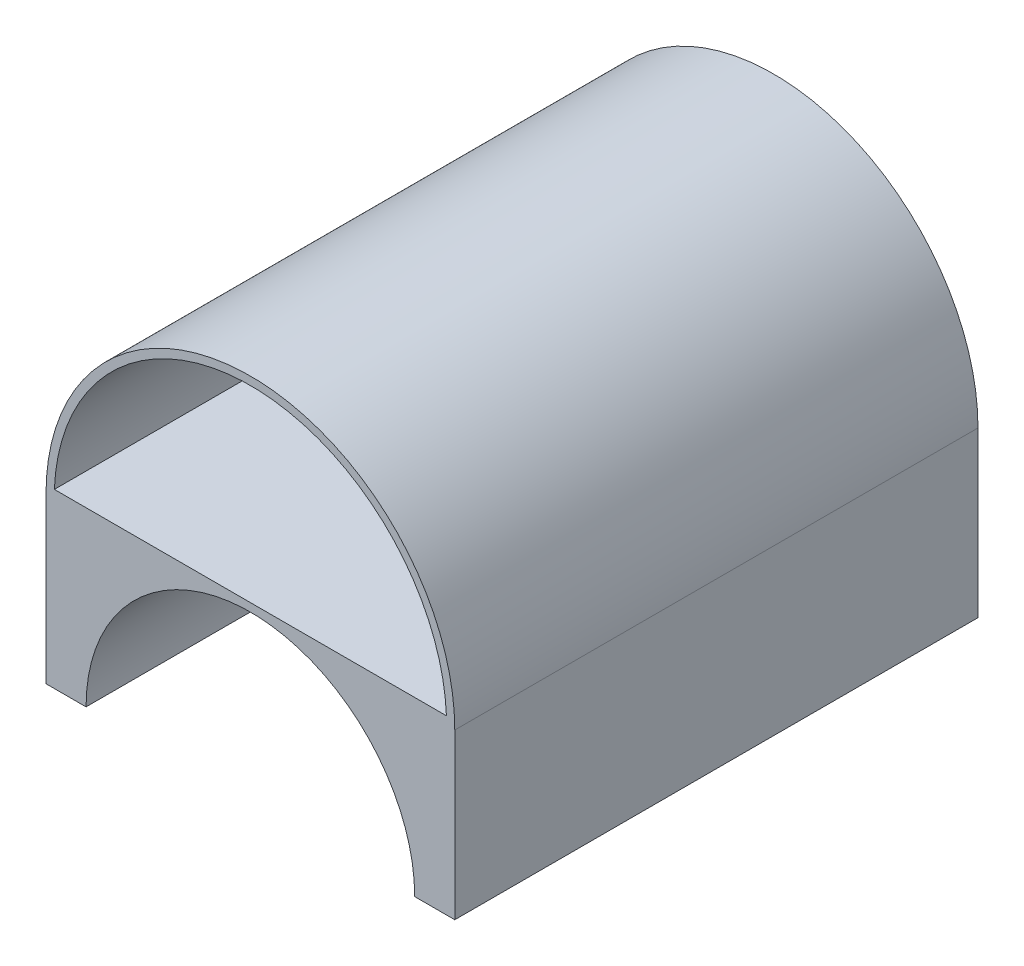
ISO-10303-21;
HEADER;
FILE_DESCRIPTION(('STEP AP214'),'2;1');
FILE_NAME('part.step','',(''),(''),'','','');
FILE_SCHEMA(('AUTOMOTIVE_DESIGN { 1 0 10303 214 1 1 1 1 }'));
ENDSEC;
DATA;
#1=APPLICATION_CONTEXT('core data for automotive mechanical design processes');
#2=APPLICATION_PROTOCOL_DEFINITION('international standard','automotive_design',2000,#1);
#3=PRODUCT_CONTEXT('',#1,'mechanical');
#4=PRODUCT('Part','Part','',(#3));
#5=PRODUCT_RELATED_PRODUCT_CATEGORY('part','',(#4));
#6=PRODUCT_DEFINITION_FORMATION('','',#4);
#7=PRODUCT_DEFINITION_CONTEXT('part definition',#1,'design');
#8=PRODUCT_DEFINITION('design','',#6,#7);
#9=PRODUCT_DEFINITION_SHAPE('','',#8);
#10=(LENGTH_UNIT() NAMED_UNIT(*) SI_UNIT(.MILLI.,.METRE.));
#11=(NAMED_UNIT(*) PLANE_ANGLE_UNIT() SI_UNIT($,.RADIAN.));
#12=(NAMED_UNIT(*) SI_UNIT($,.STERADIAN.) SOLID_ANGLE_UNIT());
#13=UNCERTAINTY_MEASURE_WITH_UNIT(LENGTH_MEASURE(1.E-05),#10,'distance_accuracy_value','');
#14=(GEOMETRIC_REPRESENTATION_CONTEXT(3) GLOBAL_UNCERTAINTY_ASSIGNED_CONTEXT((#13)) GLOBAL_UNIT_ASSIGNED_CONTEXT((#10,
#11,#12)) REPRESENTATION_CONTEXT('',''));
#15=CARTESIAN_POINT('',(0.,0.,0.));
#16=DIRECTION('',(0.,0.,1.));
#17=DIRECTION('',(1.,0.,0.));
#18=AXIS2_PLACEMENT_3D('',#15,#16,#17);
#19=CARTESIAN_POINT('',(0.,0.,0.));
#20=DIRECTION('',(0.,0.,-1.));
#21=DIRECTION('',(-1.,0.,0.));
#22=AXIS2_PLACEMENT_3D('',#19,#20,#21);
#23=PLANE('',#22);
#24=CARTESIAN_POINT('',(0.,0.,0.));
#25=DIRECTION('',(0.,0.,1.));
#26=DIRECTION('',(-1.,0.,0.));
#27=AXIS2_PLACEMENT_3D('',#24,#25,#26);
#28=CIRCLE('',#27,31.75);
#29=CARTESIAN_POINT('',(31.75,0.,0.));
#30=VERTEX_POINT('',#29);
#31=CARTESIAN_POINT('',(-31.75,0.,0.));
#32=VERTEX_POINT('',#31);
#33=EDGE_CURVE('E136',#30,#32,#28,.T.);
#34=ORIENTED_EDGE('',*,*,#33,.T.);
#35=DIRECTION('',(0.,-1.,0.));
#36=VECTOR('',#35,1.);
#37=CARTESIAN_POINT('',(-31.75,0.,0.));
#38=LINE('',#37,#36);
#39=CARTESIAN_POINT('',(-31.75,-25.527,0.));
#40=VERTEX_POINT('',#39);
#41=EDGE_CURVE('E168',#32,#40,#38,.T.);
#42=ORIENTED_EDGE('',*,*,#41,.T.);
#43=DIRECTION('',(1.,0.,0.));
#44=VECTOR('',#43,1.);
#45=CARTESIAN_POINT('',(0.,-25.527,0.));
#46=LINE('',#45,#44);
#47=CARTESIAN_POINT('',(-25.527,-25.527,0.));
#48=VERTEX_POINT('',#47);
#49=EDGE_CURVE('E164',#40,#48,#46,.T.);
#50=ORIENTED_EDGE('',*,*,#49,.T.);
#51=CARTESIAN_POINT('',(0.,-25.527,0.));
#52=DIRECTION('',(0.,0.,1.));
#53=DIRECTION('',(1.,0.,0.));
#54=AXIS2_PLACEMENT_3D('',#51,#52,#53);
#55=CIRCLE('',#54,25.527);
#56=CARTESIAN_POINT('',(25.527,-25.527,0.));
#57=VERTEX_POINT('',#56);
#58=EDGE_CURVE('E140',#57,#48,#55,.T.);
#59=ORIENTED_EDGE('',*,*,#58,.F.);
#60=DIRECTION('',(1.,0.,0.));
#61=VECTOR('',#60,1.);
#62=CARTESIAN_POINT('',(0.,-25.527,0.));
#63=LINE('',#62,#61);
#64=CARTESIAN_POINT('',(31.75,-25.527,0.));
#65=VERTEX_POINT('',#64);
#66=EDGE_CURVE('E139',#57,#65,#63,.T.);
#67=ORIENTED_EDGE('',*,*,#66,.T.);
#68=DIRECTION('',(0.,1.,0.));
#69=VECTOR('',#68,1.);
#70=CARTESIAN_POINT('',(31.75,0.,0.));
#71=LINE('',#70,#69);
#72=EDGE_CURVE('E127',#65,#30,#71,.T.);
#73=ORIENTED_EDGE('',*,*,#72,.T.);
#74=EDGE_LOOP('',(#34,#42,#50,#59,#67,#73));
#75=FACE_BOUND('',#74,.T.);
#76=CARTESIAN_POINT('',(0.,0.,0.));
#77=DIRECTION('',(0.,0.,-1.));
#78=DIRECTION('',(-1.,0.,0.));
#79=AXIS2_PLACEMENT_3D('',#76,#77,#78);
#80=CIRCLE('',#79,30.48);
#81=CARTESIAN_POINT('',(30.4535301730358,1.27000000000001,0.));
#82=VERTEX_POINT('',#81);
#83=CARTESIAN_POINT('',(-30.4535301730358,1.27,0.));
#84=VERTEX_POINT('',#83);
#85=EDGE_CURVE('E76',#82,#84,#80,.F.);
#86=ORIENTED_EDGE('',*,*,#85,.F.);
#87=DIRECTION('',(1.,0.,0.));
#88=VECTOR('',#87,1.);
#89=CARTESIAN_POINT('',(-31.75,1.27,0.));
#90=LINE('',#89,#88);
#91=EDGE_CURVE('E148',#84,#82,#90,.T.);
#92=ORIENTED_EDGE('',*,*,#91,.F.);
#93=EDGE_LOOP('',(#86,#92));
#94=FACE_BOUND('',#93,.T.);
#95=ADVANCED_FACE('F61',(#75,#94),#23,.F.);
#96=CARTESIAN_POINT('',(0.,0.,-81.28));
#97=DIRECTION('',(0.,0.,1.));
#98=DIRECTION('',(1.,0.,0.));
#99=AXIS2_PLACEMENT_3D('',#96,#97,#98);
#100=CYLINDRICAL_SURFACE('',#99,31.75);
#101=ORIENTED_EDGE('',*,*,#33,.F.);
#102=DIRECTION('',(0.,0.,1.));
#103=VECTOR('',#102,1.);
#104=CARTESIAN_POINT('',(31.75,0.,-81.28));
#105=LINE('',#104,#103);
#106=CARTESIAN_POINT('',(31.75,0.,-81.28));
#107=VERTEX_POINT('',#106);
#108=EDGE_CURVE('E12',#107,#30,#105,.T.);
#109=ORIENTED_EDGE('',*,*,#108,.F.);
#110=CARTESIAN_POINT('',(0.,0.,-81.28));
#111=DIRECTION('',(0.,0.,1.));
#112=DIRECTION('',(-1.,0.,0.));
#113=AXIS2_PLACEMENT_3D('',#110,#111,#112);
#114=CIRCLE('',#113,31.75);
#115=CARTESIAN_POINT('',(-31.75,0.,-81.28));
#116=VERTEX_POINT('',#115);
#117=EDGE_CURVE('E85',#107,#116,#114,.T.);
#118=ORIENTED_EDGE('',*,*,#117,.T.);
#119=DIRECTION('',(0.,0.,1.));
#120=VECTOR('',#119,1.);
#121=CARTESIAN_POINT('',(-31.75,0.,-81.28));
#122=LINE('',#121,#120);
#123=EDGE_CURVE('E65',#116,#32,#122,.T.);
#124=ORIENTED_EDGE('',*,*,#123,.T.);
#125=EDGE_LOOP('',(#101,#109,#118,#124));
#126=FACE_BOUND('',#125,.T.);
#127=ADVANCED_FACE('F63',(#126),#100,.T.);
#128=CARTESIAN_POINT('',(0.,0.,-81.28));
#129=DIRECTION('',(0.,0.,-1.));
#130=DIRECTION('',(-1.,0.,0.));
#131=AXIS2_PLACEMENT_3D('',#128,#129,#130);
#132=PLANE('',#131);
#133=ORIENTED_EDGE('',*,*,#117,.F.);
#134=DIRECTION('',(0.,1.,0.));
#135=VECTOR('',#134,1.);
#136=CARTESIAN_POINT('',(31.75,0.,-81.28));
#137=LINE('',#136,#135);
#138=CARTESIAN_POINT('',(31.75,-25.527,-81.28));
#139=VERTEX_POINT('',#138);
#140=EDGE_CURVE('E130',#139,#107,#137,.T.);
#141=ORIENTED_EDGE('',*,*,#140,.F.);
#142=DIRECTION('',(1.,0.,0.));
#143=VECTOR('',#142,1.);
#144=CARTESIAN_POINT('',(0.,-25.527,-81.28));
#145=LINE('',#144,#143);
#146=CARTESIAN_POINT('',(25.527,-25.527,-81.28));
#147=VERTEX_POINT('',#146);
#148=EDGE_CURVE('E178',#147,#139,#145,.T.);
#149=ORIENTED_EDGE('',*,*,#148,.F.);
#150=CARTESIAN_POINT('',(0.,-25.527,-81.28));
#151=DIRECTION('',(0.,0.,1.));
#152=DIRECTION('',(1.,0.,0.));
#153=AXIS2_PLACEMENT_3D('',#150,#151,#152);
#154=CIRCLE('',#153,25.527);
#155=CARTESIAN_POINT('',(-25.527,-25.527,-81.28));
#156=VERTEX_POINT('',#155);
#157=EDGE_CURVE('E167',#147,#156,#154,.T.);
#158=ORIENTED_EDGE('',*,*,#157,.T.);
#159=DIRECTION('',(1.,0.,0.));
#160=VECTOR('',#159,1.);
#161=CARTESIAN_POINT('',(0.,-25.527,-81.28));
#162=LINE('',#161,#160);
#163=CARTESIAN_POINT('',(-31.75,-25.527,-81.28));
#164=VERTEX_POINT('',#163);
#165=EDGE_CURVE('E162',#164,#156,#162,.T.);
#166=ORIENTED_EDGE('',*,*,#165,.F.);
#167=DIRECTION('',(0.,-1.,0.));
#168=VECTOR('',#167,1.);
#169=CARTESIAN_POINT('',(-31.75,0.,-81.28));
#170=LINE('',#169,#168);
#171=EDGE_CURVE('E174',#116,#164,#170,.T.);
#172=ORIENTED_EDGE('',*,*,#171,.F.);
#173=EDGE_LOOP('',(#133,#141,#149,#158,#166,#172));
#174=FACE_BOUND('',#173,.T.);
#175=ADVANCED_FACE('F195',(#174),#132,.T.);
#176=CARTESIAN_POINT('',(0.,0.,-81.28));
#177=DIRECTION('',(0.,0.,1.));
#178=DIRECTION('',(1.,0.,0.));
#179=AXIS2_PLACEMENT_3D('',#176,#177,#178);
#180=CYLINDRICAL_SURFACE('',#179,30.48);
#181=ORIENTED_EDGE('',*,*,#85,.T.);
#182=DIRECTION('',(0.,0.,1.));
#183=VECTOR('',#182,1.);
#184=CARTESIAN_POINT('',(-30.4535301730358,1.27,-80.01));
#185=LINE('',#184,#183);
#186=CARTESIAN_POINT('',(-30.4535301730358,1.27,-80.01));
#187=VERTEX_POINT('',#186);
#188=EDGE_CURVE('E145',#187,#84,#185,.T.);
#189=ORIENTED_EDGE('',*,*,#188,.F.);
#190=CARTESIAN_POINT('',(0.,0.,-80.01));
#191=DIRECTION('',(0.,0.,-1.));
#192=DIRECTION('',(-1.,0.,0.));
#193=AXIS2_PLACEMENT_3D('',#190,#191,#192);
#194=CIRCLE('',#193,30.48);
#195=CARTESIAN_POINT('',(30.4535301730358,1.27000000000001,-80.01));
#196=VERTEX_POINT('',#195);
#197=EDGE_CURVE('E151',#196,#187,#194,.F.);
#198=ORIENTED_EDGE('',*,*,#197,.F.);
#199=DIRECTION('',(0.,0.,1.));
#200=VECTOR('',#199,1.);
#201=CARTESIAN_POINT('',(30.4535301730358,1.27000000000001,-80.01));
#202=LINE('',#201,#200);
#203=EDGE_CURVE('E142',#196,#82,#202,.T.);
#204=ORIENTED_EDGE('',*,*,#203,.T.);
#205=EDGE_LOOP('',(#181,#189,#198,#204));
#206=FACE_BOUND('',#205,.T.);
#207=ADVANCED_FACE('F220',(#206),#180,.F.);
#208=CARTESIAN_POINT('',(-31.75,1.27,-81.28));
#209=DIRECTION('',(0.,-1.,0.));
#210=DIRECTION('',(1.,0.,0.));
#211=AXIS2_PLACEMENT_3D('',#208,#209,#210);
#212=PLANE('',#211);
#213=ORIENTED_EDGE('',*,*,#91,.T.);
#214=ORIENTED_EDGE('',*,*,#203,.F.);
#215=DIRECTION('',(1.,0.,0.));
#216=VECTOR('',#215,1.);
#217=CARTESIAN_POINT('',(-31.75,1.27,-80.01));
#218=LINE('',#217,#216);
#219=EDGE_CURVE('E154',#187,#196,#218,.T.);
#220=ORIENTED_EDGE('',*,*,#219,.F.);
#221=ORIENTED_EDGE('',*,*,#188,.T.);
#222=EDGE_LOOP('',(#213,#214,#220,#221));
#223=FACE_BOUND('',#222,.T.);
#224=ADVANCED_FACE('F223',(#223),#212,.F.);
#225=CARTESIAN_POINT('',(0.,0.,-80.01));
#226=DIRECTION('',(0.,0.,-1.));
#227=DIRECTION('',(-1.,0.,0.));
#228=AXIS2_PLACEMENT_3D('',#225,#226,#227);
#229=PLANE('',#228);
#230=ORIENTED_EDGE('',*,*,#197,.T.);
#231=ORIENTED_EDGE('',*,*,#219,.T.);
#232=EDGE_LOOP('',(#230,#231));
#233=FACE_BOUND('',#232,.T.);
#234=ADVANCED_FACE('F210',(#233),#229,.F.);
#235=CARTESIAN_POINT('',(0.,-25.527,-81.28));
#236=DIRECTION('',(0.,0.,1.));
#237=DIRECTION('',(1.,0.,0.));
#238=AXIS2_PLACEMENT_3D('',#235,#236,#237);
#239=CYLINDRICAL_SURFACE('',#238,25.527);
#240=ORIENTED_EDGE('',*,*,#58,.T.);
#241=DIRECTION('',(0.,0.,1.));
#242=VECTOR('',#241,1.);
#243=CARTESIAN_POINT('',(-25.527,-25.527,-81.28));
#244=LINE('',#243,#242);
#245=EDGE_CURVE('E153',#156,#48,#244,.T.);
#246=ORIENTED_EDGE('',*,*,#245,.F.);
#247=ORIENTED_EDGE('',*,*,#157,.F.);
#248=DIRECTION('',(0.,0.,1.));
#249=VECTOR('',#248,1.);
#250=CARTESIAN_POINT('',(25.527,-25.527,-81.28));
#251=LINE('',#250,#249);
#252=EDGE_CURVE('E183',#147,#57,#251,.T.);
#253=ORIENTED_EDGE('',*,*,#252,.T.);
#254=EDGE_LOOP('',(#240,#246,#247,#253));
#255=FACE_BOUND('',#254,.T.);
#256=ADVANCED_FACE('F189',(#255),#239,.F.);
#257=CARTESIAN_POINT('',(0.,-25.527,-81.28));
#258=DIRECTION('',(0.,-1.,0.));
#259=DIRECTION('',(0.,0.,-1.));
#260=AXIS2_PLACEMENT_3D('',#257,#258,#259);
#261=PLANE('',#260);
#262=ORIENTED_EDGE('',*,*,#49,.F.);
#263=DIRECTION('',(0.,0.,1.));
#264=VECTOR('',#263,1.);
#265=CARTESIAN_POINT('',(-31.75,-25.527,-81.28));
#266=LINE('',#265,#264);
#267=EDGE_CURVE('E160',#164,#40,#266,.T.);
#268=ORIENTED_EDGE('',*,*,#267,.F.);
#269=ORIENTED_EDGE('',*,*,#165,.T.);
#270=ORIENTED_EDGE('',*,*,#245,.T.);
#271=EDGE_LOOP('',(#262,#268,#269,#270));
#272=FACE_BOUND('',#271,.T.);
#273=ADVANCED_FACE('F202',(#272),#261,.T.);
#274=CARTESIAN_POINT('',(-31.75,0.,-81.28));
#275=DIRECTION('',(-1.,0.,0.));
#276=DIRECTION('',(0.,0.,1.));
#277=AXIS2_PLACEMENT_3D('',#274,#275,#276);
#278=PLANE('',#277);
#279=ORIENTED_EDGE('',*,*,#41,.F.);
#280=ORIENTED_EDGE('',*,*,#123,.F.);
#281=ORIENTED_EDGE('',*,*,#171,.T.);
#282=ORIENTED_EDGE('',*,*,#267,.T.);
#283=EDGE_LOOP('',(#279,#280,#281,#282));
#284=FACE_BOUND('',#283,.T.);
#285=ADVANCED_FACE('F199',(#284),#278,.T.);
#286=CARTESIAN_POINT('',(31.75,0.,-81.28));
#287=DIRECTION('',(1.,0.,0.));
#288=DIRECTION('',(0.,0.,-1.));
#289=AXIS2_PLACEMENT_3D('',#286,#287,#288);
#290=PLANE('',#289);
#291=ORIENTED_EDGE('',*,*,#72,.F.);
#292=DIRECTION('',(0.,0.,1.));
#293=VECTOR('',#292,1.);
#294=CARTESIAN_POINT('',(31.75,-25.527,-81.28));
#295=LINE('',#294,#293);
#296=EDGE_CURVE('E181',#139,#65,#295,.T.);
#297=ORIENTED_EDGE('',*,*,#296,.F.);
#298=ORIENTED_EDGE('',*,*,#140,.T.);
#299=ORIENTED_EDGE('',*,*,#108,.T.);
#300=EDGE_LOOP('',(#291,#297,#298,#299));
#301=FACE_BOUND('',#300,.T.);
#302=ADVANCED_FACE('F126',(#301),#290,.T.);
#303=CARTESIAN_POINT('',(0.,-25.527,-81.28));
#304=DIRECTION('',(0.,-1.,0.));
#305=DIRECTION('',(0.,0.,-1.));
#306=AXIS2_PLACEMENT_3D('',#303,#304,#305);
#307=PLANE('',#306);
#308=ORIENTED_EDGE('',*,*,#66,.F.);
#309=ORIENTED_EDGE('',*,*,#252,.F.);
#310=ORIENTED_EDGE('',*,*,#148,.T.);
#311=ORIENTED_EDGE('',*,*,#296,.T.);
#312=EDGE_LOOP('',(#308,#309,#310,#311));
#313=FACE_BOUND('',#312,.T.);
#314=ADVANCED_FACE('F193',(#313),#307,.T.);
#315=CLOSED_SHELL('',(#95,#127,#175,#207,#224,#234,#256,#273,#285,#302,#314));
#316=MANIFOLD_SOLID_BREP('B2',#315);
#317=ADVANCED_BREP_SHAPE_REPRESENTATION('',(#18,#316),#14);
#318=SHAPE_DEFINITION_REPRESENTATION(#9,#317);
ENDSEC;
END-ISO-10303-21;
